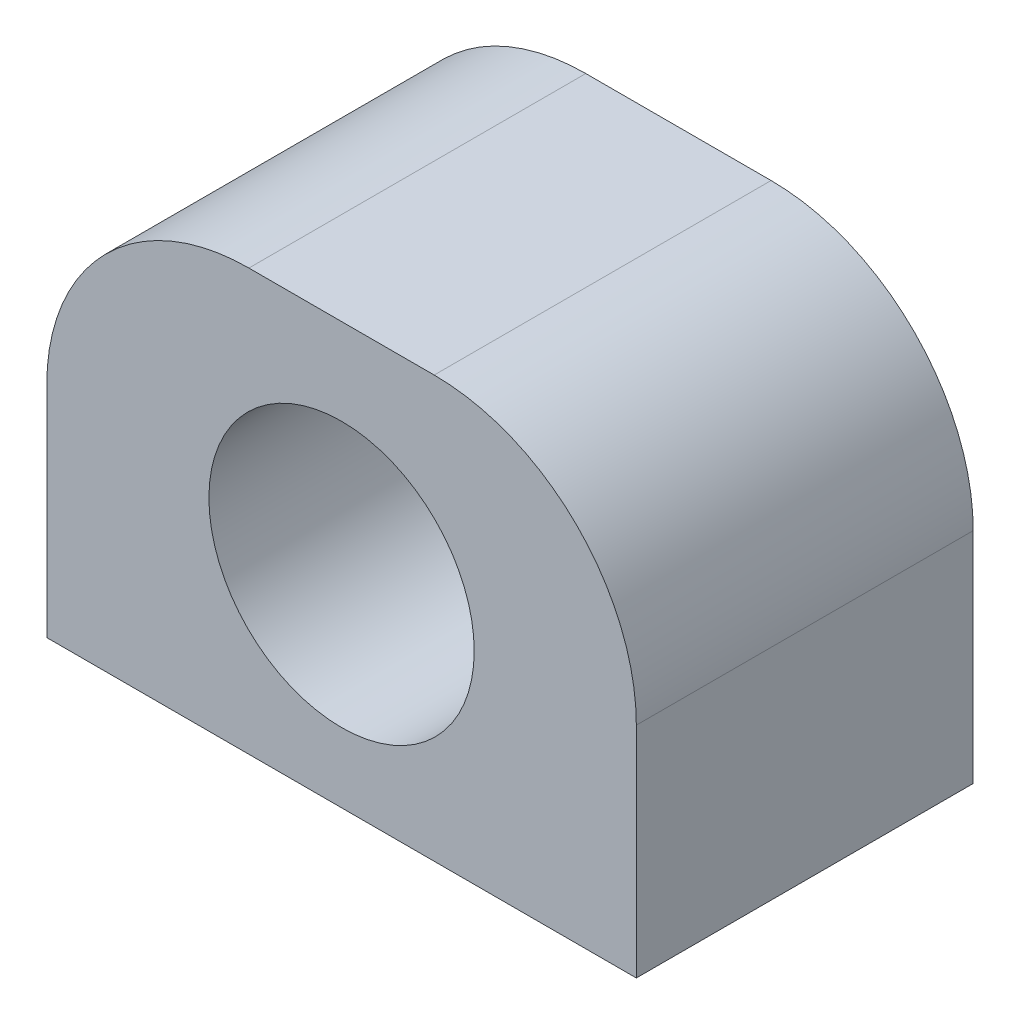
ISO-10303-21;
HEADER;
FILE_DESCRIPTION(('STEP AP214'),'2;1');
FILE_NAME('part.step','',(''),(''),'','','');
FILE_SCHEMA(('AUTOMOTIVE_DESIGN { 1 0 10303 214 1 1 1 1 }'));
ENDSEC;
DATA;
#1=APPLICATION_CONTEXT('core data for automotive mechanical design processes');
#2=APPLICATION_PROTOCOL_DEFINITION('international standard','automotive_design',2000,#1);
#3=PRODUCT_CONTEXT('',#1,'mechanical');
#4=PRODUCT('Part','Part','',(#3));
#5=PRODUCT_RELATED_PRODUCT_CATEGORY('part','',(#4));
#6=PRODUCT_DEFINITION_FORMATION('','',#4);
#7=PRODUCT_DEFINITION_CONTEXT('part definition',#1,'design');
#8=PRODUCT_DEFINITION('design','',#6,#7);
#9=PRODUCT_DEFINITION_SHAPE('','',#8);
#10=(LENGTH_UNIT() NAMED_UNIT(*) SI_UNIT(.MILLI.,.METRE.));
#11=(NAMED_UNIT(*) PLANE_ANGLE_UNIT() SI_UNIT($,.RADIAN.));
#12=(NAMED_UNIT(*) SI_UNIT($,.STERADIAN.) SOLID_ANGLE_UNIT());
#13=UNCERTAINTY_MEASURE_WITH_UNIT(LENGTH_MEASURE(1.E-05),#10,'distance_accuracy_value','');
#14=(GEOMETRIC_REPRESENTATION_CONTEXT(3) GLOBAL_UNCERTAINTY_ASSIGNED_CONTEXT((#13)) GLOBAL_UNIT_ASSIGNED_CONTEXT((#10,
#11,#12)) REPRESENTATION_CONTEXT('',''));
#15=CARTESIAN_POINT('',(0.,0.,0.));
#16=DIRECTION('',(0.,0.,1.));
#17=DIRECTION('',(1.,0.,0.));
#18=AXIS2_PLACEMENT_3D('',#15,#16,#17);
#19=CARTESIAN_POINT('',(-16.3353241489162,25.,-9.14482917573461));
#20=DIRECTION('',(1.,0.,0.));
#21=DIRECTION('',(0.,0.,-1.));
#22=AXIS2_PLACEMENT_3D('',#19,#20,#21);
#23=PLANE('',#22);
#24=DIRECTION('',(0.,-1.,0.));
#25=VECTOR('',#24,1.);
#26=CARTESIAN_POINT('',(-16.3353241489162,25.,10.8551708242654));
#27=LINE('',#26,#25);
#28=CARTESIAN_POINT('',(-16.3353241489162,13.,10.8551708242654));
#29=VERTEX_POINT('',#28);
#30=CARTESIAN_POINT('',(-16.3353241489162,0.,10.8551708242654));
#31=VERTEX_POINT('',#30);
#32=EDGE_CURVE('E84',#29,#31,#27,.T.);
#33=ORIENTED_EDGE('',*,*,#32,.F.);
#34=DIRECTION('',(0.,0.,1.));
#35=VECTOR('',#34,1.);
#36=CARTESIAN_POINT('',(-16.3353241489162,13.,-9.14482917573461));
#37=LINE('',#36,#35);
#38=CARTESIAN_POINT('',(-16.3353241489162,13.,-9.14482917573461));
#39=VERTEX_POINT('',#38);
#40=EDGE_CURVE('E11',#29,#39,#37,.F.);
#41=ORIENTED_EDGE('',*,*,#40,.T.);
#42=DIRECTION('',(0.,-1.,0.));
#43=VECTOR('',#42,1.);
#44=CARTESIAN_POINT('',(-16.3353241489162,25.,-9.14482917573461));
#45=LINE('',#44,#43);
#46=CARTESIAN_POINT('',(-16.3353241489162,0.,-9.14482917573461));
#47=VERTEX_POINT('',#46);
#48=EDGE_CURVE('E104',#39,#47,#45,.T.);
#49=ORIENTED_EDGE('',*,*,#48,.T.);
#50=DIRECTION('',(0.,0.,1.));
#51=VECTOR('',#50,1.);
#52=CARTESIAN_POINT('',(-16.3353241489162,0.,-9.14482917573461));
#53=LINE('',#52,#51);
#54=EDGE_CURVE('E99',#47,#31,#53,.T.);
#55=ORIENTED_EDGE('',*,*,#54,.T.);
#56=EDGE_LOOP('',(#33,#41,#49,#55));
#57=FACE_BOUND('',#56,.T.);
#58=ADVANCED_FACE('F33',(#57),#23,.F.);
#59=CARTESIAN_POINT('',(-16.3353241489162,25.,10.8551708242654));
#60=DIRECTION('',(0.,0.,-1.));
#61=DIRECTION('',(-1.,0.,0.));
#62=AXIS2_PLACEMENT_3D('',#59,#60,#61);
#63=PLANE('',#62);
#64=CARTESIAN_POINT('',(1.16467585108376,12.,10.8551708242654));
#65=DIRECTION('',(0.,0.,1.));
#66=DIRECTION('',(1.,0.,0.));
#67=AXIS2_PLACEMENT_3D('',#64,#65,#66);
#68=CIRCLE('',#67,7.875);
#69=CARTESIAN_POINT('',(9.03967585108376,12.,10.8551708242654));
#70=VERTEX_POINT('',#69);
#71=EDGE_CURVE('E109',#70,#70,#68,.T.);
#72=ORIENTED_EDGE('',*,*,#71,.F.);
#73=EDGE_LOOP('',(#72));
#74=FACE_BOUND('',#73,.T.);
#75=DIRECTION('',(0.,-1.,0.));
#76=VECTOR('',#75,1.);
#77=CARTESIAN_POINT('',(18.6646758510838,25.,10.8551708242654));
#78=LINE('',#77,#76);
#79=CARTESIAN_POINT('',(18.6646758510838,13.,10.8551708242654));
#80=VERTEX_POINT('',#79);
#81=CARTESIAN_POINT('',(18.6646758510838,0.,10.8551708242654));
#82=VERTEX_POINT('',#81);
#83=EDGE_CURVE('E93',#80,#82,#78,.T.);
#84=ORIENTED_EDGE('',*,*,#83,.F.);
#85=CARTESIAN_POINT('',(6.66467585108376,13.,10.8551708242654));
#86=DIRECTION('',(0.,0.,-1.));
#87=DIRECTION('',(-1.,0.,0.));
#88=AXIS2_PLACEMENT_3D('',#85,#86,#87);
#89=CIRCLE('',#88,12.);
#90=CARTESIAN_POINT('',(6.66467585108376,25.,10.8551708242654));
#91=VERTEX_POINT('',#90);
#92=EDGE_CURVE('E41',#80,#91,#89,.F.);
#93=ORIENTED_EDGE('',*,*,#92,.T.);
#94=DIRECTION('',(1.,0.,0.));
#95=VECTOR('',#94,1.);
#96=CARTESIAN_POINT('',(-16.3353241489162,25.,10.8551708242654));
#97=LINE('',#96,#95);
#98=CARTESIAN_POINT('',(-4.33532414891624,25.,10.8551708242654));
#99=VERTEX_POINT('',#98);
#100=EDGE_CURVE('E118',#99,#91,#97,.T.);
#101=ORIENTED_EDGE('',*,*,#100,.F.);
#102=CARTESIAN_POINT('',(-4.33532414891624,13.,10.8551708242654));
#103=DIRECTION('',(0.,0.,-1.));
#104=DIRECTION('',(-1.,0.,0.));
#105=AXIS2_PLACEMENT_3D('',#102,#103,#104);
#106=CIRCLE('',#105,12.);
#107=EDGE_CURVE('E48',#99,#29,#106,.F.);
#108=ORIENTED_EDGE('',*,*,#107,.T.);
#109=ORIENTED_EDGE('',*,*,#32,.T.);
#110=DIRECTION('',(1.,0.,0.));
#111=VECTOR('',#110,1.);
#112=CARTESIAN_POINT('',(-16.3353241489162,0.,10.8551708242654));
#113=LINE('',#112,#111);
#114=EDGE_CURVE('E87',#31,#82,#113,.T.);
#115=ORIENTED_EDGE('',*,*,#114,.T.);
#116=EDGE_LOOP('',(#84,#93,#101,#108,#109,#115));
#117=FACE_BOUND('',#116,.T.);
#118=ADVANCED_FACE('F86',(#74,#117),#63,.F.);
#119=CARTESIAN_POINT('',(18.6646758510838,25.,-9.14482917573461));
#120=DIRECTION('',(-1.,0.,0.));
#121=DIRECTION('',(0.,0.,1.));
#122=AXIS2_PLACEMENT_3D('',#119,#120,#121);
#123=PLANE('',#122);
#124=DIRECTION('',(0.,-1.,0.));
#125=VECTOR('',#124,1.);
#126=CARTESIAN_POINT('',(18.6646758510838,25.,-9.14482917573461));
#127=LINE('',#126,#125);
#128=CARTESIAN_POINT('',(18.6646758510838,13.,-9.14482917573461));
#129=VERTEX_POINT('',#128);
#130=CARTESIAN_POINT('',(18.6646758510838,0.,-9.14482917573461));
#131=VERTEX_POINT('',#130);
#132=EDGE_CURVE('E120',#129,#131,#127,.T.);
#133=ORIENTED_EDGE('',*,*,#132,.F.);
#134=DIRECTION('',(0.,0.,-1.));
#135=VECTOR('',#134,1.);
#136=CARTESIAN_POINT('',(18.6646758510838,13.,10.8551708242654));
#137=LINE('',#136,#135);
#138=EDGE_CURVE('E56',#129,#80,#137,.F.);
#139=ORIENTED_EDGE('',*,*,#138,.T.);
#140=ORIENTED_EDGE('',*,*,#83,.T.);
#141=DIRECTION('',(0.,0.,-1.));
#142=VECTOR('',#141,1.);
#143=CARTESIAN_POINT('',(18.6646758510838,0.,-9.14482917573461));
#144=LINE('',#143,#142);
#145=EDGE_CURVE('E101',#82,#131,#144,.T.);
#146=ORIENTED_EDGE('',*,*,#145,.T.);
#147=EDGE_LOOP('',(#133,#139,#140,#146));
#148=FACE_BOUND('',#147,.T.);
#149=ADVANCED_FACE('F145',(#148),#123,.F.);
#150=CARTESIAN_POINT('',(-16.3353241489162,25.,-9.14482917573461));
#151=DIRECTION('',(0.,0.,1.));
#152=DIRECTION('',(1.,0.,0.));
#153=AXIS2_PLACEMENT_3D('',#150,#151,#152);
#154=PLANE('',#153);
#155=CARTESIAN_POINT('',(1.16467585108376,12.,-9.14482917573461));
#156=DIRECTION('',(0.,0.,1.));
#157=DIRECTION('',(1.,0.,0.));
#158=AXIS2_PLACEMENT_3D('',#155,#156,#157);
#159=CIRCLE('',#158,7.875);
#160=CARTESIAN_POINT('',(9.03967585108376,12.,-9.14482917573461));
#161=VERTEX_POINT('',#160);
#162=EDGE_CURVE('E106',#161,#161,#159,.T.);
#163=ORIENTED_EDGE('',*,*,#162,.T.);
#164=EDGE_LOOP('',(#163));
#165=FACE_BOUND('',#164,.T.);
#166=DIRECTION('',(-1.,0.,0.));
#167=VECTOR('',#166,1.);
#168=CARTESIAN_POINT('',(-16.3353241489162,25.,-9.14482917573461));
#169=LINE('',#168,#167);
#170=CARTESIAN_POINT('',(6.66467585108376,25.,-9.14482917573461));
#171=VERTEX_POINT('',#170);
#172=CARTESIAN_POINT('',(-4.33532414891625,25.,-9.14482917573461));
#173=VERTEX_POINT('',#172);
#174=EDGE_CURVE('E112',#171,#173,#169,.T.);
#175=ORIENTED_EDGE('',*,*,#174,.F.);
#176=CARTESIAN_POINT('',(6.66467585108376,13.,-9.14482917573461));
#177=DIRECTION('',(0.,0.,1.));
#178=DIRECTION('',(1.,0.,0.));
#179=AXIS2_PLACEMENT_3D('',#176,#177,#178);
#180=CIRCLE('',#179,12.);
#181=EDGE_CURVE('E130',#171,#129,#180,.F.);
#182=ORIENTED_EDGE('',*,*,#181,.T.);
#183=ORIENTED_EDGE('',*,*,#132,.T.);
#184=DIRECTION('',(-1.,0.,0.));
#185=VECTOR('',#184,1.);
#186=CARTESIAN_POINT('',(-16.3353241489162,0.,-9.14482917573461));
#187=LINE('',#186,#185);
#188=EDGE_CURVE('E116',#131,#47,#187,.T.);
#189=ORIENTED_EDGE('',*,*,#188,.T.);
#190=ORIENTED_EDGE('',*,*,#48,.F.);
#191=CARTESIAN_POINT('',(-4.33532414891625,13.,-9.14482917573461));
#192=DIRECTION('',(0.,0.,1.));
#193=DIRECTION('',(1.,0.,0.));
#194=AXIS2_PLACEMENT_3D('',#191,#192,#193);
#195=CIRCLE('',#194,12.);
#196=EDGE_CURVE('E128',#39,#173,#195,.F.);
#197=ORIENTED_EDGE('',*,*,#196,.T.);
#198=EDGE_LOOP('',(#175,#182,#183,#189,#190,#197));
#199=FACE_BOUND('',#198,.T.);
#200=ADVANCED_FACE('F144',(#165,#199),#154,.F.);
#201=CARTESIAN_POINT('',(0.,25.,0.));
#202=DIRECTION('',(0.,1.,0.));
#203=DIRECTION('',(0.,0.,1.));
#204=AXIS2_PLACEMENT_3D('',#201,#202,#203);
#205=PLANE('',#204);
#206=ORIENTED_EDGE('',*,*,#100,.T.);
#207=DIRECTION('',(0.,0.,-1.));
#208=VECTOR('',#207,1.);
#209=CARTESIAN_POINT('',(6.66467585108376,25.,-9.14482917573461));
#210=LINE('',#209,#208);
#211=EDGE_CURVE('E125',#91,#171,#210,.T.);
#212=ORIENTED_EDGE('',*,*,#211,.T.);
#213=ORIENTED_EDGE('',*,*,#174,.T.);
#214=DIRECTION('',(0.,0.,1.));
#215=VECTOR('',#214,1.);
#216=CARTESIAN_POINT('',(-4.33532414891624,25.,10.8551708242654));
#217=LINE('',#216,#215);
#218=EDGE_CURVE('E92',#173,#99,#217,.T.);
#219=ORIENTED_EDGE('',*,*,#218,.T.);
#220=EDGE_LOOP('',(#206,#212,#213,#219));
#221=FACE_BOUND('',#220,.T.);
#222=ADVANCED_FACE('F138',(#221),#205,.T.);
#223=CARTESIAN_POINT('',(0.,0.,0.));
#224=DIRECTION('',(0.,1.,0.));
#225=DIRECTION('',(0.,0.,1.));
#226=AXIS2_PLACEMENT_3D('',#223,#224,#225);
#227=PLANE('',#226);
#228=CARTESIAN_POINT('',(10.6646758510838,0.,0.855170824265387));
#229=DIRECTION('',(0.,-1.,0.));
#230=DIRECTION('',(0.,0.,-1.));
#231=AXIS2_PLACEMENT_3D('',#228,#229,#230);
#232=CIRCLE('',#231,1.75);
#233=CARTESIAN_POINT('',(10.6646758510838,0.,-0.894829175734613));
#234=VERTEX_POINT('',#233);
#235=EDGE_CURVE('E195',#234,#234,#232,.T.);
#236=ORIENTED_EDGE('',*,*,#235,.F.);
#237=EDGE_LOOP('',(#236));
#238=FACE_BOUND('',#237,.T.);
#239=CARTESIAN_POINT('',(-8.33532414891625,0.,0.855170824265387));
#240=DIRECTION('',(0.,-1.,0.));
#241=DIRECTION('',(0.,0.,-1.));
#242=AXIS2_PLACEMENT_3D('',#239,#240,#241);
#243=CIRCLE('',#242,1.75);
#244=CARTESIAN_POINT('',(-8.33532414891625,0.,-0.894829175734613));
#245=VERTEX_POINT('',#244);
#246=EDGE_CURVE('E194',#245,#245,#243,.T.);
#247=ORIENTED_EDGE('',*,*,#246,.F.);
#248=EDGE_LOOP('',(#247));
#249=FACE_BOUND('',#248,.T.);
#250=ORIENTED_EDGE('',*,*,#54,.F.);
#251=ORIENTED_EDGE('',*,*,#188,.F.);
#252=ORIENTED_EDGE('',*,*,#145,.F.);
#253=ORIENTED_EDGE('',*,*,#114,.F.);
#254=EDGE_LOOP('',(#250,#251,#252,#253));
#255=FACE_BOUND('',#254,.T.);
#256=ADVANCED_FACE('F97',(#238,#249,#255),#227,.F.);
#257=CARTESIAN_POINT('',(1.16467585108376,12.,-9.14482917573461));
#258=DIRECTION('',(0.,0.,1.));
#259=DIRECTION('',(1.,0.,0.));
#260=AXIS2_PLACEMENT_3D('',#257,#258,#259);
#261=CYLINDRICAL_SURFACE('',#260,7.875);
#262=ORIENTED_EDGE('',*,*,#162,.F.);
#263=EDGE_LOOP('',(#262));
#264=FACE_BOUND('',#263,.T.);
#265=ORIENTED_EDGE('',*,*,#71,.T.);
#266=EDGE_LOOP('',(#265));
#267=FACE_BOUND('',#266,.T.);
#268=ADVANCED_FACE('F168',(#264,#267),#261,.F.);
#269=CARTESIAN_POINT('',(-8.33532414891625,10.,0.855170824265387));
#270=DIRECTION('',(0.,-1.,0.));
#271=DIRECTION('',(0.,0.,-1.));
#272=AXIS2_PLACEMENT_3D('',#269,#270,#271);
#273=CYLINDRICAL_SURFACE('',#272,1.75);
#274=CARTESIAN_POINT('',(-8.33532414891625,10.,0.855170824265387));
#275=DIRECTION('',(0.,-1.,0.));
#276=DIRECTION('',(0.,0.,-1.));
#277=AXIS2_PLACEMENT_3D('',#274,#275,#276);
#278=CIRCLE('',#277,1.75);
#279=CARTESIAN_POINT('',(-8.33532414891625,10.,-0.894829175734613));
#280=VERTEX_POINT('',#279);
#281=EDGE_CURVE('E198',#280,#280,#278,.T.);
#282=ORIENTED_EDGE('',*,*,#281,.F.);
#283=EDGE_LOOP('',(#282));
#284=FACE_BOUND('',#283,.T.);
#285=ORIENTED_EDGE('',*,*,#246,.T.);
#286=EDGE_LOOP('',(#285));
#287=FACE_BOUND('',#286,.T.);
#288=ADVANCED_FACE('F174',(#284,#287),#273,.F.);
#289=CARTESIAN_POINT('',(-8.33532414891625,10.,0.855170824265387));
#290=DIRECTION('',(0.,-1.,0.));
#291=DIRECTION('',(0.,0.,-1.));
#292=AXIS2_PLACEMENT_3D('',#289,#290,#291);
#293=PLANE('',#292);
#294=ORIENTED_EDGE('',*,*,#281,.T.);
#295=EDGE_LOOP('',(#294));
#296=FACE_BOUND('',#295,.T.);
#297=ADVANCED_FACE('F178',(#296),#293,.T.);
#298=CARTESIAN_POINT('',(10.6646758510838,10.,0.855170824265387));
#299=DIRECTION('',(0.,-1.,0.));
#300=DIRECTION('',(0.,0.,-1.));
#301=AXIS2_PLACEMENT_3D('',#298,#299,#300);
#302=CYLINDRICAL_SURFACE('',#301,1.75);
#303=CARTESIAN_POINT('',(10.6646758510838,10.,0.855170824265387));
#304=DIRECTION('',(0.,-1.,0.));
#305=DIRECTION('',(0.,0.,-1.));
#306=AXIS2_PLACEMENT_3D('',#303,#304,#305);
#307=CIRCLE('',#306,1.75);
#308=CARTESIAN_POINT('',(10.6646758510838,10.,-0.894829175734613));
#309=VERTEX_POINT('',#308);
#310=EDGE_CURVE('E193',#309,#309,#307,.T.);
#311=ORIENTED_EDGE('',*,*,#310,.F.);
#312=EDGE_LOOP('',(#311));
#313=FACE_BOUND('',#312,.T.);
#314=ORIENTED_EDGE('',*,*,#235,.T.);
#315=EDGE_LOOP('',(#314));
#316=FACE_BOUND('',#315,.T.);
#317=ADVANCED_FACE('F182',(#313,#316),#302,.F.);
#318=CARTESIAN_POINT('',(10.6646758510838,10.,0.855170824265387));
#319=DIRECTION('',(0.,-1.,0.));
#320=DIRECTION('',(0.,0.,-1.));
#321=AXIS2_PLACEMENT_3D('',#318,#319,#320);
#322=PLANE('',#321);
#323=ORIENTED_EDGE('',*,*,#310,.T.);
#324=EDGE_LOOP('',(#323));
#325=FACE_BOUND('',#324,.T.);
#326=ADVANCED_FACE('F152',(#325),#322,.T.);
#327=CARTESIAN_POINT('',(6.66467585108376,13.,0.));
#328=DIRECTION('',(0.,0.,1.));
#329=DIRECTION('',(1.,0.,0.));
#330=AXIS2_PLACEMENT_3D('',#327,#328,#329);
#331=CYLINDRICAL_SURFACE('',#330,12.);
#332=ORIENTED_EDGE('',*,*,#92,.F.);
#333=ORIENTED_EDGE('',*,*,#138,.F.);
#334=ORIENTED_EDGE('',*,*,#181,.F.);
#335=ORIENTED_EDGE('',*,*,#211,.F.);
#336=EDGE_LOOP('',(#332,#333,#334,#335));
#337=FACE_BOUND('',#336,.T.);
#338=ADVANCED_FACE('F142',(#337),#331,.T.);
#339=CARTESIAN_POINT('',(-4.33532414891625,13.,0.));
#340=DIRECTION('',(0.,0.,-1.));
#341=DIRECTION('',(-1.,0.,0.));
#342=AXIS2_PLACEMENT_3D('',#339,#340,#341);
#343=CYLINDRICAL_SURFACE('',#342,12.);
#344=ORIENTED_EDGE('',*,*,#196,.F.);
#345=ORIENTED_EDGE('',*,*,#40,.F.);
#346=ORIENTED_EDGE('',*,*,#107,.F.);
#347=ORIENTED_EDGE('',*,*,#218,.F.);
#348=EDGE_LOOP('',(#344,#345,#346,#347));
#349=FACE_BOUND('',#348,.T.);
#350=ADVANCED_FACE('F35',(#349),#343,.T.);
#351=CLOSED_SHELL('',(#58,#118,#149,#200,#222,#256,#268,#288,#297,#317,#326,#338,#350));
#352=MANIFOLD_SOLID_BREP('B2',#351);
#353=ADVANCED_BREP_SHAPE_REPRESENTATION('',(#18,#352),#14);
#354=SHAPE_DEFINITION_REPRESENTATION(#9,#353);
ENDSEC;
END-ISO-10303-21;
